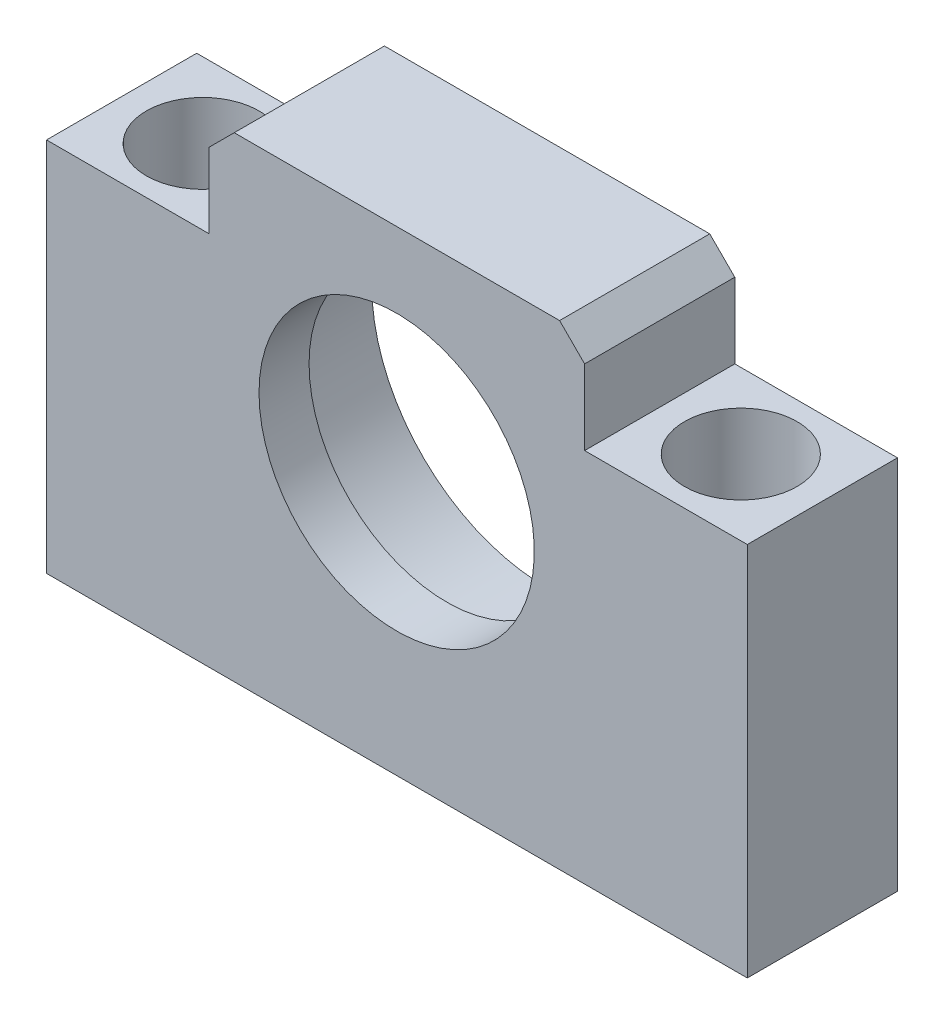
ISO-10303-21;
HEADER;
FILE_DESCRIPTION(('STEP AP214'),'2;1');
FILE_NAME('part.step','',(''),(''),'','','');
FILE_SCHEMA(('AUTOMOTIVE_DESIGN { 1 0 10303 214 1 1 1 1 }'));
ENDSEC;
DATA;
#1=APPLICATION_CONTEXT('core data for automotive mechanical design processes');
#2=APPLICATION_PROTOCOL_DEFINITION('international standard','automotive_design',2000,#1);
#3=PRODUCT_CONTEXT('',#1,'mechanical');
#4=PRODUCT('Part','Part','',(#3));
#5=PRODUCT_RELATED_PRODUCT_CATEGORY('part','',(#4));
#6=PRODUCT_DEFINITION_FORMATION('','',#4);
#7=PRODUCT_DEFINITION_CONTEXT('part definition',#1,'design');
#8=PRODUCT_DEFINITION('design','',#6,#7);
#9=PRODUCT_DEFINITION_SHAPE('','',#8);
#10=(LENGTH_UNIT() NAMED_UNIT(*) SI_UNIT(.MILLI.,.METRE.));
#11=(NAMED_UNIT(*) PLANE_ANGLE_UNIT() SI_UNIT($,.RADIAN.));
#12=(NAMED_UNIT(*) SI_UNIT($,.STERADIAN.) SOLID_ANGLE_UNIT());
#13=UNCERTAINTY_MEASURE_WITH_UNIT(LENGTH_MEASURE(1.E-05),#10,'distance_accuracy_value','');
#14=(GEOMETRIC_REPRESENTATION_CONTEXT(3) GLOBAL_UNCERTAINTY_ASSIGNED_CONTEXT((#13)) GLOBAL_UNIT_ASSIGNED_CONTEXT((#10,
#11,#12)) REPRESENTATION_CONTEXT('',''));
#15=CARTESIAN_POINT('',(0.,0.,0.));
#16=DIRECTION('',(0.,0.,1.));
#17=DIRECTION('',(1.,0.,0.));
#18=AXIS2_PLACEMENT_3D('',#15,#16,#17);
#19=CARTESIAN_POINT('',(-21.5,-14.,0.));
#20=DIRECTION('',(0.,1.,0.));
#21=DIRECTION('',(0.,0.,1.));
#22=AXIS2_PLACEMENT_3D('',#19,#20,#21);
#23=PLANE('',#22);
#24=CARTESIAN_POINT('',(-21.5,-14.,0.));
#25=DIRECTION('',(0.,1.,0.));
#26=DIRECTION('',(0.,0.,1.));
#27=AXIS2_PLACEMENT_3D('',#24,#25,#26);
#28=CIRCLE('',#27,4.5);
#29=CARTESIAN_POINT('',(-21.5,-14.,4.5));
#30=VERTEX_POINT('',#29);
#31=EDGE_CURVE('E145',#30,#30,#28,.T.);
#32=ORIENTED_EDGE('',*,*,#31,.T.);
#33=EDGE_LOOP('',(#32));
#34=FACE_BOUND('',#33,.T.);
#35=CARTESIAN_POINT('',(-21.5,-14.,0.));
#36=DIRECTION('',(0.,1.,0.));
#37=DIRECTION('',(0.,0.,1.));
#38=AXIS2_PLACEMENT_3D('',#35,#36,#37);
#39=CIRCLE('',#38,2.75);
#40=CARTESIAN_POINT('',(-21.5,-14.,2.75));
#41=VERTEX_POINT('',#40);
#42=EDGE_CURVE('E150',#41,#41,#39,.F.);
#43=ORIENTED_EDGE('',*,*,#42,.T.);
#44=EDGE_LOOP('',(#43));
#45=FACE_BOUND('',#44,.T.);
#46=ADVANCED_FACE('F17',(#34,#45),#23,.T.);
#47=CARTESIAN_POINT('',(21.5,-14.,0.));
#48=DIRECTION('',(0.,1.,0.));
#49=DIRECTION('',(0.,0.,1.));
#50=AXIS2_PLACEMENT_3D('',#47,#48,#49);
#51=PLANE('',#50);
#52=CARTESIAN_POINT('',(21.5,-14.,0.));
#53=DIRECTION('',(0.,1.,0.));
#54=DIRECTION('',(0.,0.,1.));
#55=AXIS2_PLACEMENT_3D('',#52,#53,#54);
#56=CIRCLE('',#55,4.5);
#57=CARTESIAN_POINT('',(21.5,-14.,4.5));
#58=VERTEX_POINT('',#57);
#59=EDGE_CURVE('E142',#58,#58,#56,.T.);
#60=ORIENTED_EDGE('',*,*,#59,.T.);
#61=EDGE_LOOP('',(#60));
#62=FACE_BOUND('',#61,.T.);
#63=CARTESIAN_POINT('',(21.5,-14.,0.));
#64=DIRECTION('',(0.,1.,0.));
#65=DIRECTION('',(0.,0.,1.));
#66=AXIS2_PLACEMENT_3D('',#63,#64,#65);
#67=CIRCLE('',#66,2.75);
#68=CARTESIAN_POINT('',(21.5,-14.,2.75));
#69=VERTEX_POINT('',#68);
#70=EDGE_CURVE('E148',#69,#69,#67,.F.);
#71=ORIENTED_EDGE('',*,*,#70,.T.);
#72=EDGE_LOOP('',(#71));
#73=FACE_BOUND('',#72,.T.);
#74=ADVANCED_FACE('F163',(#62,#73),#51,.T.);
#75=CARTESIAN_POINT('',(0.,0.,2.));
#76=DIRECTION('',(0.,0.,-1.));
#77=DIRECTION('',(-1.,0.,0.));
#78=AXIS2_PLACEMENT_3D('',#75,#76,#77);
#79=CYLINDRICAL_SURFACE('',#78,14.);
#80=CARTESIAN_POINT('',(0.,0.,2.));
#81=DIRECTION('',(0.,0.,-1.));
#82=DIRECTION('',(-1.,0.,0.));
#83=AXIS2_PLACEMENT_3D('',#80,#81,#82);
#84=CIRCLE('',#83,14.);
#85=CARTESIAN_POINT('',(-14.,0.,2.));
#86=VERTEX_POINT('',#85);
#87=EDGE_CURVE('E20',#86,#86,#84,.T.);
#88=ORIENTED_EDGE('',*,*,#87,.F.);
#89=EDGE_LOOP('',(#88));
#90=FACE_BOUND('',#89,.T.);
#91=CARTESIAN_POINT('',(0.,0.,-6.));
#92=DIRECTION('',(0.,0.,-1.));
#93=DIRECTION('',(-1.,0.,0.));
#94=AXIS2_PLACEMENT_3D('',#91,#92,#93);
#95=CIRCLE('',#94,14.);
#96=CARTESIAN_POINT('',(-14.,0.,-6.));
#97=VERTEX_POINT('',#96);
#98=EDGE_CURVE('E139',#97,#97,#95,.F.);
#99=ORIENTED_EDGE('',*,*,#98,.F.);
#100=EDGE_LOOP('',(#99));
#101=FACE_BOUND('',#100,.T.);
#102=ADVANCED_FACE('F160',(#90,#101),#79,.F.);
#103=CARTESIAN_POINT('',(0.,0.,2.));
#104=DIRECTION('',(0.,0.,-1.));
#105=DIRECTION('',(-1.,0.,0.));
#106=AXIS2_PLACEMENT_3D('',#103,#104,#105);
#107=PLANE('',#106);
#108=ORIENTED_EDGE('',*,*,#87,.T.);
#109=EDGE_LOOP('',(#108));
#110=FACE_BOUND('',#109,.T.);
#111=CARTESIAN_POINT('',(0.,0.,2.));
#112=DIRECTION('',(0.,0.,-1.));
#113=DIRECTION('',(-1.,0.,0.));
#114=AXIS2_PLACEMENT_3D('',#111,#112,#113);
#115=CIRCLE('',#114,11.);
#116=CARTESIAN_POINT('',(-11.,0.,2.));
#117=VERTEX_POINT('',#116);
#118=EDGE_CURVE('E136',#117,#117,#115,.F.);
#119=ORIENTED_EDGE('',*,*,#118,.T.);
#120=EDGE_LOOP('',(#119));
#121=FACE_BOUND('',#120,.T.);
#122=ADVANCED_FACE('F157',(#110,#121),#107,.T.);
#123=CARTESIAN_POINT('',(-21.5,-21.,0.));
#124=DIRECTION('',(0.,1.,0.));
#125=DIRECTION('',(0.,0.,1.));
#126=AXIS2_PLACEMENT_3D('',#123,#124,#125);
#127=CYLINDRICAL_SURFACE('',#126,2.75);
#128=ORIENTED_EDGE('',*,*,#42,.F.);
#129=EDGE_LOOP('',(#128));
#130=FACE_BOUND('',#129,.T.);
#131=CARTESIAN_POINT('',(-21.5,-21.,0.));
#132=DIRECTION('',(0.,1.,0.));
#133=DIRECTION('',(0.,0.,1.));
#134=AXIS2_PLACEMENT_3D('',#131,#132,#133);
#135=CIRCLE('',#134,2.75);
#136=CARTESIAN_POINT('',(-21.5,-21.,2.75));
#137=VERTEX_POINT('',#136);
#138=EDGE_CURVE('E133',#137,#137,#135,.F.);
#139=ORIENTED_EDGE('',*,*,#138,.T.);
#140=EDGE_LOOP('',(#139));
#141=FACE_BOUND('',#140,.T.);
#142=ADVANCED_FACE('F324',(#130,#141),#127,.F.);
#143=CARTESIAN_POINT('',(21.5,-21.,0.));
#144=DIRECTION('',(0.,1.,0.));
#145=DIRECTION('',(0.,0.,1.));
#146=AXIS2_PLACEMENT_3D('',#143,#144,#145);
#147=CYLINDRICAL_SURFACE('',#146,2.75);
#148=ORIENTED_EDGE('',*,*,#70,.F.);
#149=EDGE_LOOP('',(#148));
#150=FACE_BOUND('',#149,.T.);
#151=CARTESIAN_POINT('',(21.5,-21.,0.));
#152=DIRECTION('',(0.,1.,0.));
#153=DIRECTION('',(0.,0.,1.));
#154=AXIS2_PLACEMENT_3D('',#151,#152,#153);
#155=CIRCLE('',#154,2.75);
#156=CARTESIAN_POINT('',(21.5,-21.,2.75));
#157=VERTEX_POINT('',#156);
#158=EDGE_CURVE('E103',#157,#157,#155,.F.);
#159=ORIENTED_EDGE('',*,*,#158,.T.);
#160=EDGE_LOOP('',(#159));
#161=FACE_BOUND('',#160,.T.);
#162=ADVANCED_FACE('F315',(#150,#161),#147,.F.);
#163=CARTESIAN_POINT('',(-21.5,-14.,0.));
#164=DIRECTION('',(0.,1.,0.));
#165=DIRECTION('',(0.,0.,1.));
#166=AXIS2_PLACEMENT_3D('',#163,#164,#165);
#167=CYLINDRICAL_SURFACE('',#166,4.5);
#168=ORIENTED_EDGE('',*,*,#31,.F.);
#169=EDGE_LOOP('',(#168));
#170=FACE_BOUND('',#169,.T.);
#171=CARTESIAN_POINT('',(-21.5,9.,0.));
#172=DIRECTION('',(0.,1.,0.));
#173=DIRECTION('',(0.,0.,1.));
#174=AXIS2_PLACEMENT_3D('',#171,#172,#173);
#175=CIRCLE('',#174,4.5);
#176=CARTESIAN_POINT('',(-21.5,9.,4.5));
#177=VERTEX_POINT('',#176);
#178=EDGE_CURVE('E111',#177,#177,#175,.T.);
#179=ORIENTED_EDGE('',*,*,#178,.T.);
#180=EDGE_LOOP('',(#179));
#181=FACE_BOUND('',#180,.T.);
#182=ADVANCED_FACE('F177',(#170,#181),#167,.F.);
#183=CARTESIAN_POINT('',(21.5,-14.,0.));
#184=DIRECTION('',(0.,1.,0.));
#185=DIRECTION('',(0.,0.,1.));
#186=AXIS2_PLACEMENT_3D('',#183,#184,#185);
#187=CYLINDRICAL_SURFACE('',#186,4.5);
#188=ORIENTED_EDGE('',*,*,#59,.F.);
#189=EDGE_LOOP('',(#188));
#190=FACE_BOUND('',#189,.T.);
#191=CARTESIAN_POINT('',(21.5,9.,0.));
#192=DIRECTION('',(0.,1.,0.));
#193=DIRECTION('',(0.,0.,1.));
#194=AXIS2_PLACEMENT_3D('',#191,#192,#193);
#195=CIRCLE('',#194,4.5);
#196=CARTESIAN_POINT('',(21.5,9.,4.5));
#197=VERTEX_POINT('',#196);
#198=EDGE_CURVE('E124',#197,#197,#195,.T.);
#199=ORIENTED_EDGE('',*,*,#198,.T.);
#200=EDGE_LOOP('',(#199));
#201=FACE_BOUND('',#200,.T.);
#202=ADVANCED_FACE('F168',(#190,#201),#187,.F.);
#203=CARTESIAN_POINT('',(-27.97958971654,9.,-6.));
#204=DIRECTION('',(0.,0.,-1.));
#205=DIRECTION('',(-1.,0.,0.));
#206=AXIS2_PLACEMENT_3D('',#203,#204,#205);
#207=PLANE('',#206);
#208=DIRECTION('',(1.,0.,0.));
#209=VECTOR('',#208,1.);
#210=CARTESIAN_POINT('',(28.02041028346,9.,-6.));
#211=LINE('',#210,#209);
#212=CARTESIAN_POINT('',(15.02041028346,9.,-6.));
#213=VERTEX_POINT('',#212);
#214=CARTESIAN_POINT('',(28.02041028346,9.00000000000001,-6.));
#215=VERTEX_POINT('',#214);
#216=EDGE_CURVE('E424',#213,#215,#211,.T.);
#217=ORIENTED_EDGE('',*,*,#216,.T.);
#218=DIRECTION('',(0.,1.,0.));
#219=VECTOR('',#218,1.);
#220=CARTESIAN_POINT('',(28.02041028346,-21.,-6.));
#221=LINE('',#220,#219);
#222=CARTESIAN_POINT('',(28.02041028346,-21.,-6.));
#223=VERTEX_POINT('',#222);
#224=EDGE_CURVE('E97',#215,#223,#221,.F.);
#225=ORIENTED_EDGE('',*,*,#224,.T.);
#226=DIRECTION('',(1.,0.,0.));
#227=VECTOR('',#226,1.);
#228=CARTESIAN_POINT('',(-27.97958971654,-21.,-6.));
#229=LINE('',#228,#227);
#230=CARTESIAN_POINT('',(-27.97958971654,-21.,-6.));
#231=VERTEX_POINT('',#230);
#232=EDGE_CURVE('E94',#223,#231,#229,.F.);
#233=ORIENTED_EDGE('',*,*,#232,.T.);
#234=DIRECTION('',(0.,1.,0.));
#235=VECTOR('',#234,1.);
#236=CARTESIAN_POINT('',(-27.97958971654,-21.,-6.));
#237=LINE('',#236,#235);
#238=CARTESIAN_POINT('',(-27.97958971654,9.00000000000001,-6.));
#239=VERTEX_POINT('',#238);
#240=EDGE_CURVE('E91',#231,#239,#237,.T.);
#241=ORIENTED_EDGE('',*,*,#240,.T.);
#242=DIRECTION('',(1.,0.,0.));
#243=VECTOR('',#242,1.);
#244=CARTESIAN_POINT('',(-27.97958971654,9.,-6.));
#245=LINE('',#244,#243);
#246=CARTESIAN_POINT('',(-14.97958971654,9.,-6.));
#247=VERTEX_POINT('',#246);
#248=EDGE_CURVE('E392',#239,#247,#245,.T.);
#249=ORIENTED_EDGE('',*,*,#248,.T.);
#250=DIRECTION('',(0.,1.,0.));
#251=VECTOR('',#250,1.);
#252=CARTESIAN_POINT('',(-14.97958971654,15.,-6.));
#253=LINE('',#252,#251);
#254=CARTESIAN_POINT('',(-14.97958971654,15.,-6.));
#255=VERTEX_POINT('',#254);
#256=EDGE_CURVE('E398',#247,#255,#253,.T.);
#257=ORIENTED_EDGE('',*,*,#256,.T.);
#258=DIRECTION('',(0.707106781186548,0.707106781186548,0.));
#259=VECTOR('',#258,1.);
#260=CARTESIAN_POINT('',(-14.97958971654,15.,-6.00000000000001));
#261=LINE('',#260,#259);
#262=CARTESIAN_POINT('',(-12.97958971654,17.,-6.00000000000001));
#263=VERTEX_POINT('',#262);
#264=EDGE_CURVE('E406',#255,#263,#261,.T.);
#265=ORIENTED_EDGE('',*,*,#264,.T.);
#266=DIRECTION('',(1.,0.,0.));
#267=VECTOR('',#266,1.);
#268=CARTESIAN_POINT('',(13.02041028346,17.,-6.));
#269=LINE('',#268,#267);
#270=CARTESIAN_POINT('',(13.02041028346,17.,-6.));
#271=VERTEX_POINT('',#270);
#272=EDGE_CURVE('E411',#263,#271,#269,.T.);
#273=ORIENTED_EDGE('',*,*,#272,.T.);
#274=DIRECTION('',(0.707106781186548,-0.707106781186548,0.));
#275=VECTOR('',#274,1.);
#276=CARTESIAN_POINT('',(13.02041028346,17.,-6.00000000000001));
#277=LINE('',#276,#275);
#278=CARTESIAN_POINT('',(15.02041028346,15.,-6.00000000000001));
#279=VERTEX_POINT('',#278);
#280=EDGE_CURVE('E416',#271,#279,#277,.T.);
#281=ORIENTED_EDGE('',*,*,#280,.T.);
#282=DIRECTION('',(0.,-1.,0.));
#283=VECTOR('',#282,1.);
#284=CARTESIAN_POINT('',(15.02041028346,9.,-6.));
#285=LINE('',#284,#283);
#286=EDGE_CURVE('E128',#279,#213,#285,.T.);
#287=ORIENTED_EDGE('',*,*,#286,.T.);
#288=EDGE_LOOP('',(#217,#225,#233,#241,#249,#257,#265,#273,#281,#287));
#289=FACE_BOUND('',#288,.T.);
#290=ORIENTED_EDGE('',*,*,#98,.T.);
#291=EDGE_LOOP('',(#290));
#292=FACE_BOUND('',#291,.T.);
#293=ADVANCED_FACE('F95',(#289,#292),#207,.T.);
#294=CARTESIAN_POINT('',(0.,0.,6.));
#295=DIRECTION('',(0.,0.,-1.));
#296=DIRECTION('',(-1.,0.,0.));
#297=AXIS2_PLACEMENT_3D('',#294,#295,#296);
#298=CYLINDRICAL_SURFACE('',#297,11.);
#299=ORIENTED_EDGE('',*,*,#118,.F.);
#300=EDGE_LOOP('',(#299));
#301=FACE_BOUND('',#300,.T.);
#302=CARTESIAN_POINT('',(0.,0.,6.));
#303=DIRECTION('',(0.,0.,-1.));
#304=DIRECTION('',(-1.,0.,0.));
#305=AXIS2_PLACEMENT_3D('',#302,#303,#304);
#306=CIRCLE('',#305,11.);
#307=CARTESIAN_POINT('',(-11.,0.,6.));
#308=VERTEX_POINT('',#307);
#309=EDGE_CURVE('E120',#308,#308,#306,.F.);
#310=ORIENTED_EDGE('',*,*,#309,.T.);
#311=EDGE_LOOP('',(#310));
#312=FACE_BOUND('',#311,.T.);
#313=ADVANCED_FACE('F167',(#301,#312),#298,.F.);
#314=CARTESIAN_POINT('',(-27.97958971654,-21.,6.));
#315=DIRECTION('',(0.,1.,0.));
#316=DIRECTION('',(0.,0.,1.));
#317=AXIS2_PLACEMENT_3D('',#314,#315,#316);
#318=PLANE('',#317);
#319=DIRECTION('',(0.,0.,-1.));
#320=VECTOR('',#319,1.);
#321=CARTESIAN_POINT('',(-27.97958971654,-21.,6.));
#322=LINE('',#321,#320);
#323=CARTESIAN_POINT('',(-27.97958971654,-21.,6.));
#324=VERTEX_POINT('',#323);
#325=EDGE_CURVE('E102',#324,#231,#322,.T.);
#326=ORIENTED_EDGE('',*,*,#325,.T.);
#327=ORIENTED_EDGE('',*,*,#232,.F.);
#328=DIRECTION('',(0.,0.,1.));
#329=VECTOR('',#328,1.);
#330=CARTESIAN_POINT('',(28.02041028346,-21.,6.));
#331=LINE('',#330,#329);
#332=CARTESIAN_POINT('',(28.02041028346,-21.,6.));
#333=VERTEX_POINT('',#332);
#334=EDGE_CURVE('E123',#223,#333,#331,.T.);
#335=ORIENTED_EDGE('',*,*,#334,.T.);
#336=DIRECTION('',(-1.,0.,0.));
#337=VECTOR('',#336,1.);
#338=CARTESIAN_POINT('',(-27.97958971654,-21.,6.));
#339=LINE('',#338,#337);
#340=EDGE_CURVE('E116',#333,#324,#339,.T.);
#341=ORIENTED_EDGE('',*,*,#340,.T.);
#342=EDGE_LOOP('',(#326,#327,#335,#341));
#343=FACE_BOUND('',#342,.T.);
#344=ORIENTED_EDGE('',*,*,#158,.F.);
#345=EDGE_LOOP('',(#344));
#346=FACE_BOUND('',#345,.T.);
#347=ORIENTED_EDGE('',*,*,#138,.F.);
#348=EDGE_LOOP('',(#347));
#349=FACE_BOUND('',#348,.T.);
#350=ADVANCED_FACE('F114',(#343,#346,#349),#318,.F.);
#351=CARTESIAN_POINT('',(-27.97958971654,-21.,6.));
#352=DIRECTION('',(1.,0.,0.));
#353=DIRECTION('',(0.,0.,-1.));
#354=AXIS2_PLACEMENT_3D('',#351,#352,#353);
#355=PLANE('',#354);
#356=DIRECTION('',(0.,0.,-1.));
#357=VECTOR('',#356,1.);
#358=CARTESIAN_POINT('',(-27.97958971654,9.,6.));
#359=LINE('',#358,#357);
#360=CARTESIAN_POINT('',(-27.97958971654,9.00000000000001,6.));
#361=VERTEX_POINT('',#360);
#362=EDGE_CURVE('E110',#361,#239,#359,.T.);
#363=ORIENTED_EDGE('',*,*,#362,.T.);
#364=ORIENTED_EDGE('',*,*,#240,.F.);
#365=ORIENTED_EDGE('',*,*,#325,.F.);
#366=DIRECTION('',(0.,1.,0.));
#367=VECTOR('',#366,1.);
#368=CARTESIAN_POINT('',(-27.97958971654,9.,6.));
#369=LINE('',#368,#367);
#370=EDGE_CURVE('E430',#324,#361,#369,.T.);
#371=ORIENTED_EDGE('',*,*,#370,.T.);
#372=EDGE_LOOP('',(#363,#364,#365,#371));
#373=FACE_BOUND('',#372,.T.);
#374=ADVANCED_FACE('F107',(#373),#355,.F.);
#375=CARTESIAN_POINT('',(-27.97958971654,9.,6.));
#376=DIRECTION('',(0.,-1.,0.));
#377=DIRECTION('',(0.,0.,-1.));
#378=AXIS2_PLACEMENT_3D('',#375,#376,#377);
#379=PLANE('',#378);
#380=DIRECTION('',(0.,0.,-1.));
#381=VECTOR('',#380,1.);
#382=CARTESIAN_POINT('',(-14.97958971654,9.,6.));
#383=LINE('',#382,#381);
#384=CARTESIAN_POINT('',(-14.97958971654,9.,6.));
#385=VERTEX_POINT('',#384);
#386=EDGE_CURVE('E391',#385,#247,#383,.T.);
#387=ORIENTED_EDGE('',*,*,#386,.T.);
#388=ORIENTED_EDGE('',*,*,#248,.F.);
#389=ORIENTED_EDGE('',*,*,#362,.F.);
#390=DIRECTION('',(-1.,0.,0.));
#391=VECTOR('',#390,1.);
#392=CARTESIAN_POINT('',(-27.97958971654,9.,6.));
#393=LINE('',#392,#391);
#394=EDGE_CURVE('E394',#361,#385,#393,.F.);
#395=ORIENTED_EDGE('',*,*,#394,.T.);
#396=EDGE_LOOP('',(#387,#388,#389,#395));
#397=FACE_BOUND('',#396,.T.);
#398=ORIENTED_EDGE('',*,*,#178,.F.);
#399=EDGE_LOOP('',(#398));
#400=FACE_BOUND('',#399,.T.);
#401=ADVANCED_FACE('F215',(#397,#400),#379,.F.);
#402=CARTESIAN_POINT('',(-14.97958971654,15.,6.));
#403=DIRECTION('',(1.,0.,0.));
#404=DIRECTION('',(0.,0.,-1.));
#405=AXIS2_PLACEMENT_3D('',#402,#403,#404);
#406=PLANE('',#405);
#407=DIRECTION('',(0.,0.,1.));
#408=VECTOR('',#407,1.);
#409=CARTESIAN_POINT('',(-14.97958971654,15.,6.));
#410=LINE('',#409,#408);
#411=CARTESIAN_POINT('',(-14.97958971654,15.,6.));
#412=VERTEX_POINT('',#411);
#413=EDGE_CURVE('E400',#412,#255,#410,.F.);
#414=ORIENTED_EDGE('',*,*,#413,.T.);
#415=ORIENTED_EDGE('',*,*,#256,.F.);
#416=ORIENTED_EDGE('',*,*,#386,.F.);
#417=DIRECTION('',(0.,1.,0.));
#418=VECTOR('',#417,1.);
#419=CARTESIAN_POINT('',(-14.97958971654,9.,6.));
#420=LINE('',#419,#418);
#421=EDGE_CURVE('E433',#385,#412,#420,.T.);
#422=ORIENTED_EDGE('',*,*,#421,.T.);
#423=EDGE_LOOP('',(#414,#415,#416,#422));
#424=FACE_BOUND('',#423,.T.);
#425=ADVANCED_FACE('F211',(#424),#406,.F.);
#426=CARTESIAN_POINT('',(-14.97958971654,15.,6.));
#427=DIRECTION('',(0.707106781186548,-0.707106781186548,0.));
#428=DIRECTION('',(0.707106781186548,0.707106781186548,0.));
#429=AXIS2_PLACEMENT_3D('',#426,#427,#428);
#430=PLANE('',#429);
#431=DIRECTION('',(0.,0.,-1.));
#432=VECTOR('',#431,1.);
#433=CARTESIAN_POINT('',(-12.97958971654,17.,6.));
#434=LINE('',#433,#432);
#435=CARTESIAN_POINT('',(-12.97958971654,17.,6.));
#436=VERTEX_POINT('',#435);
#437=EDGE_CURVE('E408',#436,#263,#434,.T.);
#438=ORIENTED_EDGE('',*,*,#437,.T.);
#439=ORIENTED_EDGE('',*,*,#264,.F.);
#440=ORIENTED_EDGE('',*,*,#413,.F.);
#441=DIRECTION('',(0.707106781186547,0.707106781186548,0.));
#442=VECTOR('',#441,1.);
#443=CARTESIAN_POINT('',(-14.97958971654,15.,6.));
#444=LINE('',#443,#442);
#445=EDGE_CURVE('E435',#412,#436,#444,.T.);
#446=ORIENTED_EDGE('',*,*,#445,.T.);
#447=EDGE_LOOP('',(#438,#439,#440,#446));
#448=FACE_BOUND('',#447,.T.);
#449=ADVANCED_FACE('F207',(#448),#430,.F.);
#450=CARTESIAN_POINT('',(13.02041028346,17.,6.));
#451=DIRECTION('',(0.,-1.,0.));
#452=DIRECTION('',(0.,0.,-1.));
#453=AXIS2_PLACEMENT_3D('',#450,#451,#452);
#454=PLANE('',#453);
#455=DIRECTION('',(0.,0.,1.));
#456=VECTOR('',#455,1.);
#457=CARTESIAN_POINT('',(13.02041028346,17.,6.));
#458=LINE('',#457,#456);
#459=CARTESIAN_POINT('',(13.02041028346,17.,6.));
#460=VERTEX_POINT('',#459);
#461=EDGE_CURVE('E413',#460,#271,#458,.F.);
#462=ORIENTED_EDGE('',*,*,#461,.T.);
#463=ORIENTED_EDGE('',*,*,#272,.F.);
#464=ORIENTED_EDGE('',*,*,#437,.F.);
#465=DIRECTION('',(-1.,0.,0.));
#466=VECTOR('',#465,1.);
#467=CARTESIAN_POINT('',(-27.97958971654,17.,6.));
#468=LINE('',#467,#466);
#469=EDGE_CURVE('E438',#436,#460,#468,.F.);
#470=ORIENTED_EDGE('',*,*,#469,.T.);
#471=EDGE_LOOP('',(#462,#463,#464,#470));
#472=FACE_BOUND('',#471,.T.);
#473=ADVANCED_FACE('F203',(#472),#454,.F.);
#474=CARTESIAN_POINT('',(13.02041028346,17.,6.));
#475=DIRECTION('',(-0.707106781186548,-0.707106781186548,0.));
#476=DIRECTION('',(0.707106781186548,-0.707106781186548,0.));
#477=AXIS2_PLACEMENT_3D('',#474,#475,#476);
#478=PLANE('',#477);
#479=DIRECTION('',(0.,0.,1.));
#480=VECTOR('',#479,1.);
#481=CARTESIAN_POINT('',(15.0204102834599,15.,6.));
#482=LINE('',#481,#480);
#483=CARTESIAN_POINT('',(15.02041028346,15.,6.));
#484=VERTEX_POINT('',#483);
#485=EDGE_CURVE('E418',#484,#279,#482,.F.);
#486=ORIENTED_EDGE('',*,*,#485,.T.);
#487=ORIENTED_EDGE('',*,*,#280,.F.);
#488=ORIENTED_EDGE('',*,*,#461,.F.);
#489=DIRECTION('',(0.707106781186543,-0.707106781186552,0.));
#490=VECTOR('',#489,1.);
#491=CARTESIAN_POINT('',(13.02041028346,17.,6.));
#492=LINE('',#491,#490);
#493=EDGE_CURVE('E441',#460,#484,#492,.T.);
#494=ORIENTED_EDGE('',*,*,#493,.T.);
#495=EDGE_LOOP('',(#486,#487,#488,#494));
#496=FACE_BOUND('',#495,.T.);
#497=ADVANCED_FACE('F199',(#496),#478,.F.);
#498=CARTESIAN_POINT('',(15.02041028346,9.,6.));
#499=DIRECTION('',(-1.,0.,0.));
#500=DIRECTION('',(0.,-1.,0.));
#501=AXIS2_PLACEMENT_3D('',#498,#499,#500);
#502=PLANE('',#501);
#503=DIRECTION('',(0.,0.,-1.));
#504=VECTOR('',#503,1.);
#505=CARTESIAN_POINT('',(15.02041028346,9.,6.));
#506=LINE('',#505,#504);
#507=CARTESIAN_POINT('',(15.02041028346,9.,6.));
#508=VERTEX_POINT('',#507);
#509=EDGE_CURVE('E127',#508,#213,#506,.T.);
#510=ORIENTED_EDGE('',*,*,#509,.T.);
#511=ORIENTED_EDGE('',*,*,#286,.F.);
#512=ORIENTED_EDGE('',*,*,#485,.F.);
#513=DIRECTION('',(0.,1.,0.));
#514=VECTOR('',#513,1.);
#515=CARTESIAN_POINT('',(15.02041028346,9.,6.));
#516=LINE('',#515,#514);
#517=EDGE_CURVE('E444',#484,#508,#516,.F.);
#518=ORIENTED_EDGE('',*,*,#517,.T.);
#519=EDGE_LOOP('',(#510,#511,#512,#518));
#520=FACE_BOUND('',#519,.T.);
#521=ADVANCED_FACE('F195',(#520),#502,.F.);
#522=CARTESIAN_POINT('',(28.02041028346,9.,6.));
#523=DIRECTION('',(0.,-1.,0.));
#524=DIRECTION('',(0.,0.,-1.));
#525=AXIS2_PLACEMENT_3D('',#522,#523,#524);
#526=PLANE('',#525);
#527=DIRECTION('',(0.,0.,1.));
#528=VECTOR('',#527,1.);
#529=CARTESIAN_POINT('',(28.02041028346,9.00000000000001,6.));
#530=LINE('',#529,#528);
#531=CARTESIAN_POINT('',(28.02041028346,9.00000000000001,6.));
#532=VERTEX_POINT('',#531);
#533=EDGE_CURVE('E34',#532,#215,#530,.F.);
#534=ORIENTED_EDGE('',*,*,#533,.T.);
#535=ORIENTED_EDGE('',*,*,#216,.F.);
#536=ORIENTED_EDGE('',*,*,#509,.F.);
#537=DIRECTION('',(-1.,0.,0.));
#538=VECTOR('',#537,1.);
#539=CARTESIAN_POINT('',(-27.97958971654,9.,6.));
#540=LINE('',#539,#538);
#541=EDGE_CURVE('E26',#508,#532,#540,.F.);
#542=ORIENTED_EDGE('',*,*,#541,.T.);
#543=EDGE_LOOP('',(#534,#535,#536,#542));
#544=FACE_BOUND('',#543,.T.);
#545=ORIENTED_EDGE('',*,*,#198,.F.);
#546=EDGE_LOOP('',(#545));
#547=FACE_BOUND('',#546,.T.);
#548=ADVANCED_FACE('F188',(#544,#547),#526,.F.);
#549=CARTESIAN_POINT('',(28.02041028346,-21.,6.));
#550=DIRECTION('',(-1.,0.,0.));
#551=DIRECTION('',(0.,0.,1.));
#552=AXIS2_PLACEMENT_3D('',#549,#550,#551);
#553=PLANE('',#552);
#554=ORIENTED_EDGE('',*,*,#334,.F.);
#555=ORIENTED_EDGE('',*,*,#224,.F.);
#556=ORIENTED_EDGE('',*,*,#533,.F.);
#557=DIRECTION('',(0.,1.,0.));
#558=VECTOR('',#557,1.);
#559=CARTESIAN_POINT('',(28.02041028346,9.,6.));
#560=LINE('',#559,#558);
#561=EDGE_CURVE('E11',#532,#333,#560,.F.);
#562=ORIENTED_EDGE('',*,*,#561,.T.);
#563=EDGE_LOOP('',(#554,#555,#556,#562));
#564=FACE_BOUND('',#563,.T.);
#565=ADVANCED_FACE('F182',(#564),#553,.F.);
#566=CARTESIAN_POINT('',(-27.97958971654,9.,6.));
#567=DIRECTION('',(0.,0.,-1.));
#568=DIRECTION('',(-1.,0.,0.));
#569=AXIS2_PLACEMENT_3D('',#566,#567,#568);
#570=PLANE('',#569);
#571=ORIENTED_EDGE('',*,*,#541,.F.);
#572=ORIENTED_EDGE('',*,*,#517,.F.);
#573=ORIENTED_EDGE('',*,*,#493,.F.);
#574=ORIENTED_EDGE('',*,*,#469,.F.);
#575=ORIENTED_EDGE('',*,*,#445,.F.);
#576=ORIENTED_EDGE('',*,*,#421,.F.);
#577=ORIENTED_EDGE('',*,*,#394,.F.);
#578=ORIENTED_EDGE('',*,*,#370,.F.);
#579=ORIENTED_EDGE('',*,*,#340,.F.);
#580=ORIENTED_EDGE('',*,*,#561,.F.);
#581=EDGE_LOOP('',(#571,#572,#573,#574,#575,#576,#577,#578,#579,#580));
#582=FACE_BOUND('',#581,.T.);
#583=ORIENTED_EDGE('',*,*,#309,.F.);
#584=EDGE_LOOP('',(#583));
#585=FACE_BOUND('',#584,.T.);
#586=ADVANCED_FACE('F180',(#582,#585),#570,.F.);
#587=CLOSED_SHELL('',(#46,#74,#102,#122,#142,#162,#182,#202,#293,#313,#350,#374,#401,#425,#449,
#473,#497,#521,#548,#565,#586));
#588=MANIFOLD_SOLID_BREP('B1',#587);
#589=ADVANCED_BREP_SHAPE_REPRESENTATION('',(#18,#588),#14);
#590=SHAPE_DEFINITION_REPRESENTATION(#9,#589);
ENDSEC;
END-ISO-10303-21;
